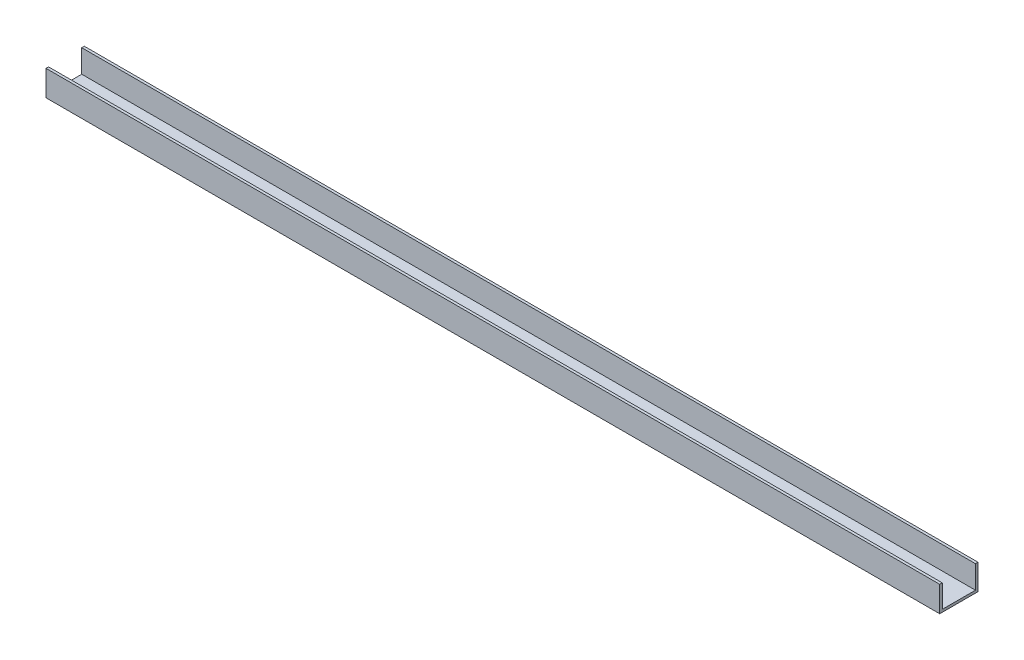
ISO-10303-21;
HEADER;
FILE_DESCRIPTION(('STEP AP214'),'2;1');
FILE_NAME('part.step','',(''),(''),'','','');
FILE_SCHEMA(('AUTOMOTIVE_DESIGN { 1 0 10303 214 1 1 1 1 }'));
ENDSEC;
DATA;
#1=APPLICATION_CONTEXT('core data for automotive mechanical design processes');
#2=APPLICATION_PROTOCOL_DEFINITION('international standard','automotive_design',2000,#1);
#3=PRODUCT_CONTEXT('',#1,'mechanical');
#4=PRODUCT('Part','Part','',(#3));
#5=PRODUCT_RELATED_PRODUCT_CATEGORY('part','',(#4));
#6=PRODUCT_DEFINITION_FORMATION('','',#4);
#7=PRODUCT_DEFINITION_CONTEXT('part definition',#1,'design');
#8=PRODUCT_DEFINITION('design','',#6,#7);
#9=PRODUCT_DEFINITION_SHAPE('','',#8);
#10=(LENGTH_UNIT() NAMED_UNIT(*) SI_UNIT(.MILLI.,.METRE.));
#11=(NAMED_UNIT(*) PLANE_ANGLE_UNIT() SI_UNIT($,.RADIAN.));
#12=(NAMED_UNIT(*) SI_UNIT($,.STERADIAN.) SOLID_ANGLE_UNIT());
#13=UNCERTAINTY_MEASURE_WITH_UNIT(LENGTH_MEASURE(1.E-05),#10,'distance_accuracy_value','');
#14=(GEOMETRIC_REPRESENTATION_CONTEXT(3) GLOBAL_UNCERTAINTY_ASSIGNED_CONTEXT((#13)) GLOBAL_UNIT_ASSIGNED_CONTEXT((#10,
#11,#12)) REPRESENTATION_CONTEXT('',''));
#15=CARTESIAN_POINT('',(0.,0.,0.));
#16=DIRECTION('',(0.,0.,1.));
#17=DIRECTION('',(1.,0.,0.));
#18=AXIS2_PLACEMENT_3D('',#15,#16,#17);
#19=CARTESIAN_POINT('',(39.483557786923,10.,-129.939976596929));
#20=DIRECTION('',(1.,0.,0.));
#21=DIRECTION('',(0.,0.,-1.));
#22=AXIS2_PLACEMENT_3D('',#19,#20,#21);
#23=PLANE('',#22);
#24=DIRECTION('',(0.,1.,0.));
#25=VECTOR('',#24,1.);
#26=CARTESIAN_POINT('',(39.483557786923,0.999999999999999,-115.939976596929));
#27=LINE('',#26,#25);
#28=CARTESIAN_POINT('',(39.483557786923,0.999999999999999,-115.939976596929));
#29=VERTEX_POINT('',#28);
#30=CARTESIAN_POINT('',(39.483557786923,10.,-115.939976596929));
#31=VERTEX_POINT('',#30);
#32=EDGE_CURVE('E130',#29,#31,#27,.T.);
#33=ORIENTED_EDGE('',*,*,#32,.F.);
#34=DIRECTION('',(0.,0.,1.));
#35=VECTOR('',#34,1.);
#36=CARTESIAN_POINT('',(39.483557786923,0.999999999999999,0.));
#37=LINE('',#36,#35);
#38=CARTESIAN_POINT('',(39.483557786923,0.999999999999999,-128.939976596929));
#39=VERTEX_POINT('',#38);
#40=EDGE_CURVE('E114',#39,#29,#37,.T.);
#41=ORIENTED_EDGE('',*,*,#40,.F.);
#42=DIRECTION('',(0.,1.,0.));
#43=VECTOR('',#42,1.);
#44=CARTESIAN_POINT('',(39.483557786923,0.999999999999999,-128.939976596929));
#45=LINE('',#44,#43);
#46=CARTESIAN_POINT('',(39.483557786923,10.,-128.939976596929));
#47=VERTEX_POINT('',#46);
#48=EDGE_CURVE('E110',#39,#47,#45,.T.);
#49=ORIENTED_EDGE('',*,*,#48,.T.);
#50=DIRECTION('',(0.,0.,1.));
#51=VECTOR('',#50,1.);
#52=CARTESIAN_POINT('',(39.483557786923,10.,-129.939976596929));
#53=LINE('',#52,#51);
#54=CARTESIAN_POINT('',(39.483557786923,10.,-129.939976596929));
#55=VERTEX_POINT('',#54);
#56=EDGE_CURVE('E135',#55,#47,#53,.T.);
#57=ORIENTED_EDGE('',*,*,#56,.F.);
#58=DIRECTION('',(0.,-1.,0.));
#59=VECTOR('',#58,1.);
#60=CARTESIAN_POINT('',(39.483557786923,10.,-129.939976596929));
#61=LINE('',#60,#59);
#62=CARTESIAN_POINT('',(39.483557786923,0.,-129.939976596929));
#63=VERTEX_POINT('',#62);
#64=EDGE_CURVE('E143',#55,#63,#61,.T.);
#65=ORIENTED_EDGE('',*,*,#64,.T.);
#66=DIRECTION('',(0.,0.,1.));
#67=VECTOR('',#66,1.);
#68=CARTESIAN_POINT('',(39.483557786923,0.,-129.939976596929));
#69=LINE('',#68,#67);
#70=CARTESIAN_POINT('',(39.483557786923,0.,-114.939976596929));
#71=VERTEX_POINT('',#70);
#72=EDGE_CURVE('E144',#63,#71,#69,.T.);
#73=ORIENTED_EDGE('',*,*,#72,.T.);
#74=DIRECTION('',(0.,-1.,0.));
#75=VECTOR('',#74,1.);
#76=CARTESIAN_POINT('',(39.483557786923,10.,-114.939976596929));
#77=LINE('',#76,#75);
#78=CARTESIAN_POINT('',(39.483557786923,10.,-114.939976596929));
#79=VERTEX_POINT('',#78);
#80=EDGE_CURVE('E11',#79,#71,#77,.T.);
#81=ORIENTED_EDGE('',*,*,#80,.F.);
#82=EDGE_CURVE('E85',#31,#79,#53,.T.);
#83=ORIENTED_EDGE('',*,*,#82,.F.);
#84=EDGE_LOOP('',(#33,#41,#49,#57,#65,#73,#81,#83));
#85=FACE_BOUND('',#84,.T.);
#86=ADVANCED_FACE('F33',(#85),#23,.F.);
#87=CARTESIAN_POINT('',(389.483557786923,10.,-129.939976596929));
#88=DIRECTION('',(-1.,0.,0.));
#89=DIRECTION('',(0.,0.,1.));
#90=AXIS2_PLACEMENT_3D('',#87,#88,#89);
#91=PLANE('',#90);
#92=DIRECTION('',(0.,1.,0.));
#93=VECTOR('',#92,1.);
#94=CARTESIAN_POINT('',(389.483557786923,0.999999999999999,-115.939976596929));
#95=LINE('',#94,#93);
#96=CARTESIAN_POINT('',(389.483557786923,0.999999999999999,-115.939976596929));
#97=VERTEX_POINT('',#96);
#98=CARTESIAN_POINT('',(389.483557786923,10.,-115.939976596929));
#99=VERTEX_POINT('',#98);
#100=EDGE_CURVE('E148',#97,#99,#95,.T.);
#101=ORIENTED_EDGE('',*,*,#100,.T.);
#102=DIRECTION('',(0.,0.,-1.));
#103=VECTOR('',#102,1.);
#104=CARTESIAN_POINT('',(389.483557786923,10.,-129.939976596929));
#105=LINE('',#104,#103);
#106=CARTESIAN_POINT('',(389.483557786923,10.,-114.939976596929));
#107=VERTEX_POINT('',#106);
#108=EDGE_CURVE('E139',#107,#99,#105,.T.);
#109=ORIENTED_EDGE('',*,*,#108,.F.);
#110=DIRECTION('',(0.,-1.,0.));
#111=VECTOR('',#110,1.);
#112=CARTESIAN_POINT('',(389.483557786923,10.,-114.939976596929));
#113=LINE('',#112,#111);
#114=CARTESIAN_POINT('',(389.483557786923,0.,-114.939976596929));
#115=VERTEX_POINT('',#114);
#116=EDGE_CURVE('E40',#107,#115,#113,.T.);
#117=ORIENTED_EDGE('',*,*,#116,.T.);
#118=DIRECTION('',(0.,0.,-1.));
#119=VECTOR('',#118,1.);
#120=CARTESIAN_POINT('',(389.483557786923,0.,-129.939976596929));
#121=LINE('',#120,#119);
#122=CARTESIAN_POINT('',(389.483557786923,0.,-129.939976596929));
#123=VERTEX_POINT('',#122);
#124=EDGE_CURVE('E150',#115,#123,#121,.T.);
#125=ORIENTED_EDGE('',*,*,#124,.T.);
#126=DIRECTION('',(0.,-1.,0.));
#127=VECTOR('',#126,1.);
#128=CARTESIAN_POINT('',(389.483557786923,10.,-129.939976596929));
#129=LINE('',#128,#127);
#130=CARTESIAN_POINT('',(389.483557786923,10.,-129.939976596929));
#131=VERTEX_POINT('',#130);
#132=EDGE_CURVE('E154',#131,#123,#129,.T.);
#133=ORIENTED_EDGE('',*,*,#132,.F.);
#134=CARTESIAN_POINT('',(389.483557786923,10.,-128.939976596929));
#135=VERTEX_POINT('',#134);
#136=EDGE_CURVE('E128',#135,#131,#105,.T.);
#137=ORIENTED_EDGE('',*,*,#136,.F.);
#138=DIRECTION('',(0.,1.,0.));
#139=VECTOR('',#138,1.);
#140=CARTESIAN_POINT('',(389.483557786923,0.999999999999999,-128.939976596929));
#141=LINE('',#140,#139);
#142=CARTESIAN_POINT('',(389.483557786923,0.999999999999999,-128.939976596929));
#143=VERTEX_POINT('',#142);
#144=EDGE_CURVE('E47',#143,#135,#141,.T.);
#145=ORIENTED_EDGE('',*,*,#144,.F.);
#146=DIRECTION('',(0.,0.,-1.));
#147=VECTOR('',#146,1.);
#148=CARTESIAN_POINT('',(389.483557786923,0.999999999999999,0.));
#149=LINE('',#148,#147);
#150=EDGE_CURVE('E115',#97,#143,#149,.T.);
#151=ORIENTED_EDGE('',*,*,#150,.F.);
#152=EDGE_LOOP('',(#101,#109,#117,#125,#133,#137,#145,#151));
#153=FACE_BOUND('',#152,.T.);
#154=ADVANCED_FACE('F126',(#153),#91,.F.);
#155=CARTESIAN_POINT('',(0.,10.,0.));
#156=DIRECTION('',(0.,1.,0.));
#157=DIRECTION('',(0.,0.,1.));
#158=AXIS2_PLACEMENT_3D('',#155,#156,#157);
#159=PLANE('',#158);
#160=ORIENTED_EDGE('',*,*,#108,.T.);
#161=DIRECTION('',(-1.,0.,0.));
#162=VECTOR('',#161,1.);
#163=CARTESIAN_POINT('',(0.,10.,-115.939976596929));
#164=LINE('',#163,#162);
#165=EDGE_CURVE('E123',#99,#31,#164,.T.);
#166=ORIENTED_EDGE('',*,*,#165,.T.);
#167=ORIENTED_EDGE('',*,*,#82,.T.);
#168=DIRECTION('',(1.,0.,0.));
#169=VECTOR('',#168,1.);
#170=CARTESIAN_POINT('',(39.483557786923,10.,-114.939976596929));
#171=LINE('',#170,#169);
#172=EDGE_CURVE('E137',#79,#107,#171,.T.);
#173=ORIENTED_EDGE('',*,*,#172,.T.);
#174=EDGE_LOOP('',(#160,#166,#167,#173));
#175=FACE_BOUND('',#174,.T.);
#176=ADVANCED_FACE('F177',(#175),#159,.T.);
#177=CARTESIAN_POINT('',(39.483557786923,10.,-114.939976596929));
#178=DIRECTION('',(0.,0.,-1.));
#179=DIRECTION('',(-1.,0.,0.));
#180=AXIS2_PLACEMENT_3D('',#177,#178,#179);
#181=PLANE('',#180);
#182=DIRECTION('',(1.,0.,0.));
#183=VECTOR('',#182,1.);
#184=CARTESIAN_POINT('',(39.483557786923,0.,-114.939976596929));
#185=LINE('',#184,#183);
#186=EDGE_CURVE('E147',#71,#115,#185,.T.);
#187=ORIENTED_EDGE('',*,*,#186,.T.);
#188=ORIENTED_EDGE('',*,*,#116,.F.);
#189=ORIENTED_EDGE('',*,*,#172,.F.);
#190=ORIENTED_EDGE('',*,*,#80,.T.);
#191=EDGE_LOOP('',(#187,#188,#189,#190));
#192=FACE_BOUND('',#191,.T.);
#193=ADVANCED_FACE('F170',(#192),#181,.F.);
#194=CARTESIAN_POINT('',(39.483557786923,10.,-129.939976596929));
#195=DIRECTION('',(0.,0.,1.));
#196=DIRECTION('',(1.,0.,0.));
#197=AXIS2_PLACEMENT_3D('',#194,#195,#196);
#198=PLANE('',#197);
#199=DIRECTION('',(-1.,0.,0.));
#200=VECTOR('',#199,1.);
#201=CARTESIAN_POINT('',(39.483557786923,0.,-129.939976596929));
#202=LINE('',#201,#200);
#203=EDGE_CURVE('E77',#123,#63,#202,.T.);
#204=ORIENTED_EDGE('',*,*,#203,.T.);
#205=ORIENTED_EDGE('',*,*,#64,.F.);
#206=DIRECTION('',(-1.,0.,0.));
#207=VECTOR('',#206,1.);
#208=CARTESIAN_POINT('',(39.483557786923,10.,-129.939976596929));
#209=LINE('',#208,#207);
#210=EDGE_CURVE('E56',#131,#55,#209,.T.);
#211=ORIENTED_EDGE('',*,*,#210,.F.);
#212=ORIENTED_EDGE('',*,*,#132,.T.);
#213=EDGE_LOOP('',(#204,#205,#211,#212));
#214=FACE_BOUND('',#213,.T.);
#215=ADVANCED_FACE('F167',(#214),#198,.F.);
#216=DIRECTION('',(-1.,0.,0.));
#217=VECTOR('',#216,1.);
#218=CARTESIAN_POINT('',(0.,10.,-128.939976596929));
#219=LINE('',#218,#217);
#220=EDGE_CURVE('E206',#135,#47,#219,.T.);
#221=ORIENTED_EDGE('',*,*,#220,.F.);
#222=ORIENTED_EDGE('',*,*,#136,.T.);
#223=ORIENTED_EDGE('',*,*,#210,.T.);
#224=ORIENTED_EDGE('',*,*,#56,.T.);
#225=EDGE_LOOP('',(#221,#222,#223,#224));
#226=FACE_BOUND('',#225,.T.);
#227=ADVANCED_FACE('F169',(#226),#159,.T.);
#228=CARTESIAN_POINT('',(0.,0.,0.));
#229=DIRECTION('',(0.,1.,0.));
#230=DIRECTION('',(0.,0.,1.));
#231=AXIS2_PLACEMENT_3D('',#228,#229,#230);
#232=PLANE('',#231);
#233=CARTESIAN_POINT('',(359.483557786923,0.,-122.439976596929));
#234=DIRECTION('',(0.,1.,0.));
#235=DIRECTION('',(0.,0.,1.));
#236=AXIS2_PLACEMENT_3D('',#233,#234,#235);
#237=CIRCLE('',#236,2.50000000000002);
#238=CARTESIAN_POINT('',(359.483557786923,0.,-119.939976596929));
#239=VERTEX_POINT('',#238);
#240=EDGE_CURVE('E201',#239,#239,#237,.T.);
#241=ORIENTED_EDGE('',*,*,#240,.T.);
#242=EDGE_LOOP('',(#241));
#243=FACE_BOUND('',#242,.T.);
#244=CARTESIAN_POINT('',(59.483557786923,0.,-122.439976596929));
#245=DIRECTION('',(0.,1.,0.));
#246=DIRECTION('',(0.,0.,1.));
#247=AXIS2_PLACEMENT_3D('',#244,#245,#246);
#248=CIRCLE('',#247,2.4);
#249=CARTESIAN_POINT('',(59.483557786923,0.,-120.039976596929));
#250=VERTEX_POINT('',#249);
#251=EDGE_CURVE('E204',#250,#250,#248,.T.);
#252=ORIENTED_EDGE('',*,*,#251,.T.);
#253=EDGE_LOOP('',(#252));
#254=FACE_BOUND('',#253,.T.);
#255=ORIENTED_EDGE('',*,*,#72,.F.);
#256=ORIENTED_EDGE('',*,*,#203,.F.);
#257=ORIENTED_EDGE('',*,*,#124,.F.);
#258=ORIENTED_EDGE('',*,*,#186,.F.);
#259=EDGE_LOOP('',(#255,#256,#257,#258));
#260=FACE_BOUND('',#259,.T.);
#261=ADVANCED_FACE('F162',(#243,#254,#260),#232,.F.);
#262=CARTESIAN_POINT('',(0.,0.999999999999999,-115.939976596929));
#263=DIRECTION('',(0.,0.,-1.));
#264=DIRECTION('',(-1.,0.,0.));
#265=AXIS2_PLACEMENT_3D('',#262,#263,#264);
#266=PLANE('',#265);
#267=ORIENTED_EDGE('',*,*,#165,.F.);
#268=ORIENTED_EDGE('',*,*,#100,.F.);
#269=DIRECTION('',(-1.,0.,0.));
#270=VECTOR('',#269,1.);
#271=CARTESIAN_POINT('',(0.,0.999999999999999,-115.939976596929));
#272=LINE('',#271,#270);
#273=EDGE_CURVE('E120',#97,#29,#272,.T.);
#274=ORIENTED_EDGE('',*,*,#273,.T.);
#275=ORIENTED_EDGE('',*,*,#32,.T.);
#276=EDGE_LOOP('',(#267,#268,#274,#275));
#277=FACE_BOUND('',#276,.T.);
#278=ADVANCED_FACE('F192',(#277),#266,.T.);
#279=CARTESIAN_POINT('',(0.,0.999999999999999,-128.939976596929));
#280=DIRECTION('',(0.,0.,-1.));
#281=DIRECTION('',(-1.,0.,0.));
#282=AXIS2_PLACEMENT_3D('',#279,#280,#281);
#283=PLANE('',#282);
#284=ORIENTED_EDGE('',*,*,#220,.T.);
#285=ORIENTED_EDGE('',*,*,#48,.F.);
#286=DIRECTION('',(-1.,0.,0.));
#287=VECTOR('',#286,1.);
#288=CARTESIAN_POINT('',(0.,0.999999999999999,-128.939976596929));
#289=LINE('',#288,#287);
#290=EDGE_CURVE('E106',#143,#39,#289,.T.);
#291=ORIENTED_EDGE('',*,*,#290,.F.);
#292=ORIENTED_EDGE('',*,*,#144,.T.);
#293=EDGE_LOOP('',(#284,#285,#291,#292));
#294=FACE_BOUND('',#293,.T.);
#295=ADVANCED_FACE('F108',(#294),#283,.F.);
#296=CARTESIAN_POINT('',(0.,0.999999999999999,0.));
#297=DIRECTION('',(0.,1.,0.));
#298=DIRECTION('',(0.,0.,1.));
#299=AXIS2_PLACEMENT_3D('',#296,#297,#298);
#300=PLANE('',#299);
#301=CARTESIAN_POINT('',(359.483557786923,0.999999999999999,-122.439976596929));
#302=DIRECTION('',(0.,1.,0.));
#303=DIRECTION('',(0.,0.,1.));
#304=AXIS2_PLACEMENT_3D('',#301,#302,#303);
#305=CIRCLE('',#304,2.50000000000002);
#306=CARTESIAN_POINT('',(359.483557786923,0.999999999999999,-119.939976596929));
#307=VERTEX_POINT('',#306);
#308=EDGE_CURVE('E217',#307,#307,#305,.T.);
#309=ORIENTED_EDGE('',*,*,#308,.F.);
#310=EDGE_LOOP('',(#309));
#311=FACE_BOUND('',#310,.T.);
#312=CARTESIAN_POINT('',(59.483557786923,0.999999999999999,-122.439976596929));
#313=DIRECTION('',(0.,1.,0.));
#314=DIRECTION('',(0.,0.,1.));
#315=AXIS2_PLACEMENT_3D('',#312,#313,#314);
#316=CIRCLE('',#315,2.4);
#317=CARTESIAN_POINT('',(59.483557786923,0.999999999999999,-120.039976596929));
#318=VERTEX_POINT('',#317);
#319=EDGE_CURVE('E207',#318,#318,#316,.T.);
#320=ORIENTED_EDGE('',*,*,#319,.F.);
#321=EDGE_LOOP('',(#320));
#322=FACE_BOUND('',#321,.T.);
#323=ORIENTED_EDGE('',*,*,#150,.T.);
#324=ORIENTED_EDGE('',*,*,#290,.T.);
#325=ORIENTED_EDGE('',*,*,#40,.T.);
#326=ORIENTED_EDGE('',*,*,#273,.F.);
#327=EDGE_LOOP('',(#323,#324,#325,#326));
#328=FACE_BOUND('',#327,.T.);
#329=ADVANCED_FACE('F119',(#311,#322,#328),#300,.T.);
#330=CARTESIAN_POINT('',(59.483557786923,-9.,-122.439976596929));
#331=DIRECTION('',(0.,1.,0.));
#332=DIRECTION('',(0.,0.,1.));
#333=AXIS2_PLACEMENT_3D('',#330,#331,#332);
#334=CYLINDRICAL_SURFACE('',#333,2.4);
#335=ORIENTED_EDGE('',*,*,#319,.T.);
#336=EDGE_LOOP('',(#335));
#337=FACE_BOUND('',#336,.T.);
#338=ORIENTED_EDGE('',*,*,#251,.F.);
#339=EDGE_LOOP('',(#338));
#340=FACE_BOUND('',#339,.T.);
#341=ADVANCED_FACE('F226',(#337,#340),#334,.F.);
#342=CARTESIAN_POINT('',(359.483557786923,-9.,-122.439976596929));
#343=DIRECTION('',(0.,1.,0.));
#344=DIRECTION('',(0.,0.,1.));
#345=AXIS2_PLACEMENT_3D('',#342,#343,#344);
#346=CYLINDRICAL_SURFACE('',#345,2.50000000000002);
#347=ORIENTED_EDGE('',*,*,#308,.T.);
#348=EDGE_LOOP('',(#347));
#349=FACE_BOUND('',#348,.T.);
#350=ORIENTED_EDGE('',*,*,#240,.F.);
#351=EDGE_LOOP('',(#350));
#352=FACE_BOUND('',#351,.T.);
#353=ADVANCED_FACE('F221',(#349,#352),#346,.F.);
#354=CLOSED_SHELL('',(#86,#154,#176,#193,#215,#227,#261,#278,#295,#329,#341,#353));
#355=MANIFOLD_SOLID_BREP('B2',#354);
#356=ADVANCED_BREP_SHAPE_REPRESENTATION('',(#18,#355),#14);
#357=SHAPE_DEFINITION_REPRESENTATION(#9,#356);
ENDSEC;
END-ISO-10303-21;
